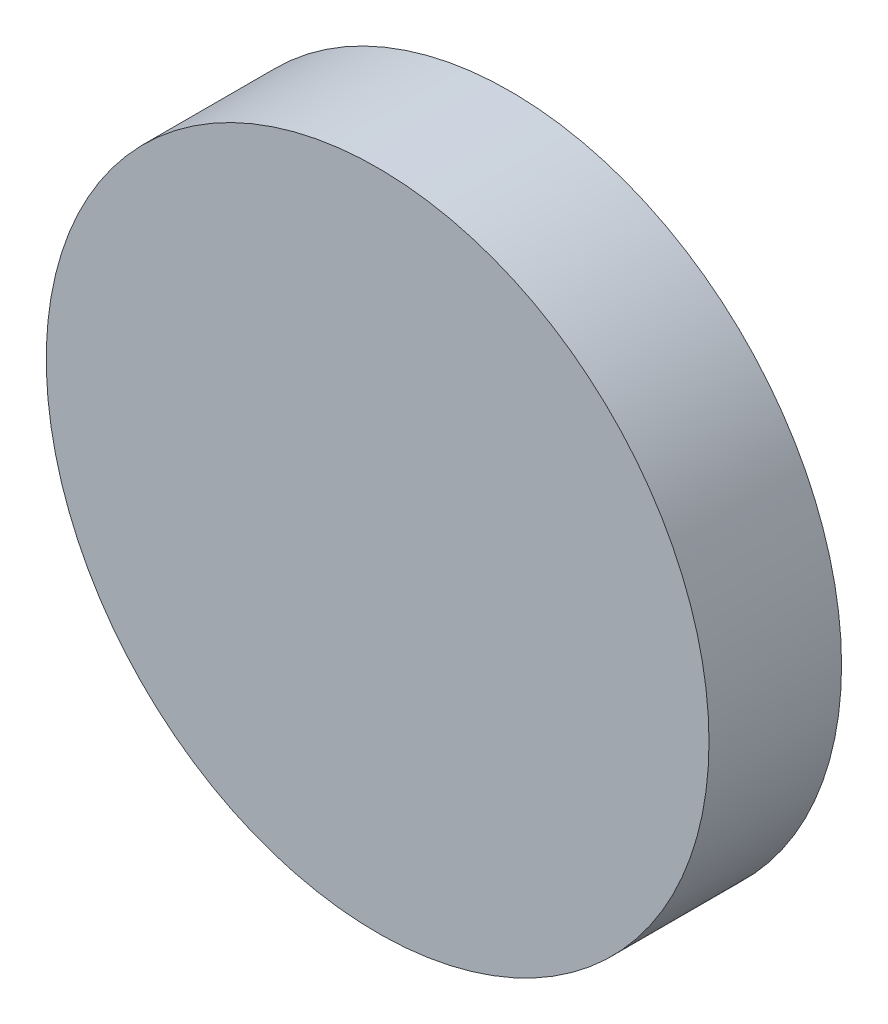
ISO-10303-21;
HEADER;
FILE_DESCRIPTION(('STEP AP214'),'2;1');
FILE_NAME('part.step','',(''),(''),'','','');
FILE_SCHEMA(('AUTOMOTIVE_DESIGN { 1 0 10303 214 1 1 1 1 }'));
ENDSEC;
DATA;
#1=APPLICATION_CONTEXT('core data for automotive mechanical design processes');
#2=APPLICATION_PROTOCOL_DEFINITION('international standard','automotive_design',2000,#1);
#3=PRODUCT_CONTEXT('',#1,'mechanical');
#4=PRODUCT('Part','Part','',(#3));
#5=PRODUCT_RELATED_PRODUCT_CATEGORY('part','',(#4));
#6=PRODUCT_DEFINITION_FORMATION('','',#4);
#7=PRODUCT_DEFINITION_CONTEXT('part definition',#1,'design');
#8=PRODUCT_DEFINITION('design','',#6,#7);
#9=PRODUCT_DEFINITION_SHAPE('','',#8);
#10=(LENGTH_UNIT() NAMED_UNIT(*) SI_UNIT(.MILLI.,.METRE.));
#11=(NAMED_UNIT(*) PLANE_ANGLE_UNIT() SI_UNIT($,.RADIAN.));
#12=(NAMED_UNIT(*) SI_UNIT($,.STERADIAN.) SOLID_ANGLE_UNIT());
#13=UNCERTAINTY_MEASURE_WITH_UNIT(LENGTH_MEASURE(1.E-05),#10,'distance_accuracy_value','');
#14=(GEOMETRIC_REPRESENTATION_CONTEXT(3) GLOBAL_UNCERTAINTY_ASSIGNED_CONTEXT((#13)) GLOBAL_UNIT_ASSIGNED_CONTEXT((#10,
#11,#12)) REPRESENTATION_CONTEXT('',''));
#15=CARTESIAN_POINT('',(0.,0.,0.));
#16=DIRECTION('',(0.,0.,1.));
#17=DIRECTION('',(1.,0.,0.));
#18=AXIS2_PLACEMENT_3D('',#15,#16,#17);
#19=CARTESIAN_POINT('',(0.,0.,6.));
#20=DIRECTION('',(0.,0.,-1.));
#21=DIRECTION('',(-1.,0.,0.));
#22=AXIS2_PLACEMENT_3D('',#19,#20,#21);
#23=CYLINDRICAL_SURFACE('',#22,15.);
#24=CARTESIAN_POINT('',(0.,0.,6.));
#25=DIRECTION('',(0.,0.,1.));
#26=DIRECTION('',(1.,0.,0.));
#27=AXIS2_PLACEMENT_3D('',#24,#25,#26);
#28=CIRCLE('',#27,15.);
#29=CARTESIAN_POINT('',(15.,0.,6.));
#30=VERTEX_POINT('',#29);
#31=EDGE_CURVE('E10',#30,#30,#28,.T.);
#32=ORIENTED_EDGE('',*,*,#31,.F.);
#33=EDGE_LOOP('',(#32));
#34=FACE_BOUND('',#33,.T.);
#35=CARTESIAN_POINT('',(0.,0.,0.));
#36=DIRECTION('',(0.,0.,1.));
#37=DIRECTION('',(1.,0.,0.));
#38=AXIS2_PLACEMENT_3D('',#35,#36,#37);
#39=CIRCLE('',#38,15.);
#40=CARTESIAN_POINT('',(15.,0.,0.));
#41=VERTEX_POINT('',#40);
#42=EDGE_CURVE('E42',#41,#41,#39,.T.);
#43=ORIENTED_EDGE('',*,*,#42,.T.);
#44=EDGE_LOOP('',(#43));
#45=FACE_BOUND('',#44,.T.);
#46=ADVANCED_FACE('F39',(#34,#45),#23,.T.);
#47=CARTESIAN_POINT('',(0.,0.,6.));
#48=DIRECTION('',(0.,0.,1.));
#49=DIRECTION('',(1.,0.,0.));
#50=AXIS2_PLACEMENT_3D('',#47,#48,#49);
#51=PLANE('',#50);
#52=ORIENTED_EDGE('',*,*,#31,.T.);
#53=EDGE_LOOP('',(#52));
#54=FACE_BOUND('',#53,.T.);
#55=ADVANCED_FACE('F56',(#54),#51,.T.);
#56=CARTESIAN_POINT('',(0.,0.,0.));
#57=DIRECTION('',(0.,0.,1.));
#58=DIRECTION('',(1.,0.,0.));
#59=AXIS2_PLACEMENT_3D('',#56,#57,#58);
#60=PLANE('',#59);
#61=ORIENTED_EDGE('',*,*,#42,.F.);
#62=EDGE_LOOP('',(#61));
#63=FACE_BOUND('',#62,.T.);
#64=ADVANCED_FACE('F54',(#63),#60,.F.);
#65=CLOSED_SHELL('',(#46,#55,#64));
#66=MANIFOLD_SOLID_BREP('B2',#65);
#67=ADVANCED_BREP_SHAPE_REPRESENTATION('',(#18,#66),#14);
#68=SHAPE_DEFINITION_REPRESENTATION(#9,#67);
ENDSEC;
END-ISO-10303-21;
